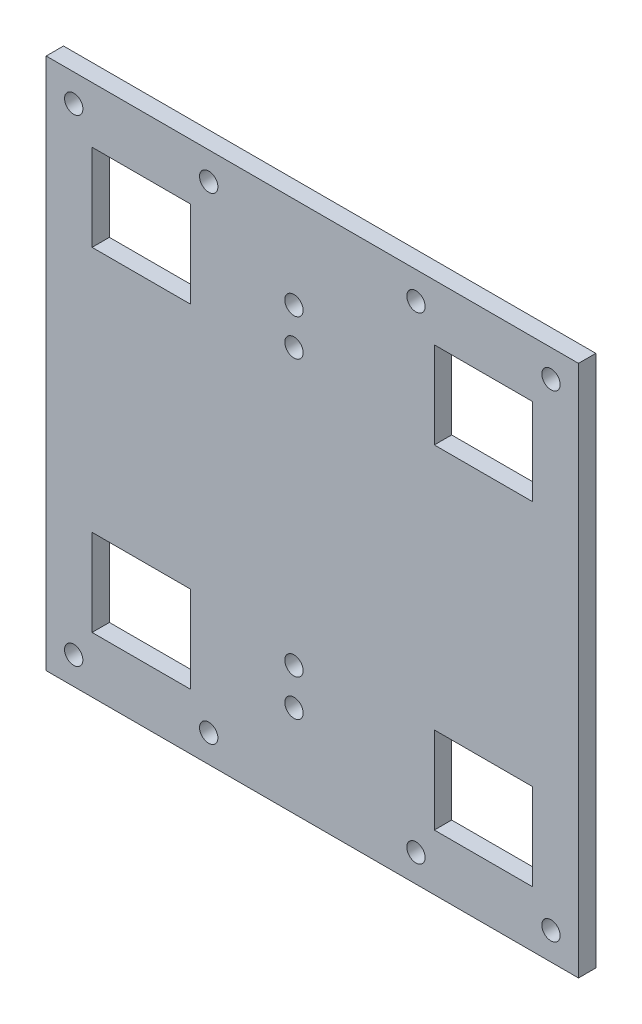
ISO-10303-21;
HEADER;
FILE_DESCRIPTION(('STEP AP214'),'2;1');
FILE_NAME('part.step','',(''),(''),'','','');
FILE_SCHEMA(('AUTOMOTIVE_DESIGN { 1 0 10303 214 1 1 1 1 }'));
ENDSEC;
DATA;
#1=APPLICATION_CONTEXT('core data for automotive mechanical design processes');
#2=APPLICATION_PROTOCOL_DEFINITION('international standard','automotive_design',2000,#1);
#3=PRODUCT_CONTEXT('',#1,'mechanical');
#4=PRODUCT('Part','Part','',(#3));
#5=PRODUCT_RELATED_PRODUCT_CATEGORY('part','',(#4));
#6=PRODUCT_DEFINITION_FORMATION('','',#4);
#7=PRODUCT_DEFINITION_CONTEXT('part definition',#1,'design');
#8=PRODUCT_DEFINITION('design','',#6,#7);
#9=PRODUCT_DEFINITION_SHAPE('','',#8);
#10=(LENGTH_UNIT() NAMED_UNIT(*) SI_UNIT(.MILLI.,.METRE.));
#11=(NAMED_UNIT(*) PLANE_ANGLE_UNIT() SI_UNIT($,.RADIAN.));
#12=(NAMED_UNIT(*) SI_UNIT($,.STERADIAN.) SOLID_ANGLE_UNIT());
#13=UNCERTAINTY_MEASURE_WITH_UNIT(LENGTH_MEASURE(1.E-05),#10,'distance_accuracy_value','');
#14=(GEOMETRIC_REPRESENTATION_CONTEXT(3) GLOBAL_UNCERTAINTY_ASSIGNED_CONTEXT((#13)) GLOBAL_UNIT_ASSIGNED_CONTEXT((#10,
#11,#12)) REPRESENTATION_CONTEXT('',''));
#15=CARTESIAN_POINT('',(0.,0.,0.));
#16=DIRECTION('',(0.,0.,1.));
#17=DIRECTION('',(1.,0.,0.));
#18=AXIS2_PLACEMENT_3D('',#15,#16,#17);
#19=CARTESIAN_POINT('',(0.,0.,5.9944));
#20=DIRECTION('',(0.,0.,-1.));
#21=DIRECTION('',(-1.,0.,0.));
#22=AXIS2_PLACEMENT_3D('',#19,#20,#21);
#23=PLANE('',#22);
#24=CARTESIAN_POINT('',(85.725,44.45,5.9944));
#25=DIRECTION('',(0.,0.,1.));
#26=DIRECTION('',(1.,0.,0.));
#27=AXIS2_PLACEMENT_3D('',#24,#25,#26);
#28=CIRCLE('',#27,3.175);
#29=CARTESIAN_POINT('',(88.9,44.45,5.9944));
#30=VERTEX_POINT('',#29);
#31=EDGE_CURVE('E533',#30,#30,#28,.T.);
#32=ORIENTED_EDGE('',*,*,#31,.F.);
#33=EDGE_LOOP('',(#32));
#34=FACE_BOUND('',#33,.T.);
#35=CARTESIAN_POINT('',(85.725,152.4,5.9944));
#36=DIRECTION('',(0.,0.,1.));
#37=DIRECTION('',(1.,0.,0.));
#38=AXIS2_PLACEMENT_3D('',#35,#36,#37);
#39=CIRCLE('',#38,3.175);
#40=CARTESIAN_POINT('',(88.9,152.4,5.9944));
#41=VERTEX_POINT('',#40);
#42=EDGE_CURVE('E545',#41,#41,#39,.T.);
#43=ORIENTED_EDGE('',*,*,#42,.F.);
#44=EDGE_LOOP('',(#43));
#45=FACE_BOUND('',#44,.T.);
#46=CARTESIAN_POINT('',(127.92456,9.525,5.9944));
#47=DIRECTION('',(0.,0.,1.));
#48=DIRECTION('',(1.,0.,0.));
#49=AXIS2_PLACEMENT_3D('',#46,#47,#48);
#50=CIRCLE('',#49,3.175);
#51=CARTESIAN_POINT('',(131.09956,9.525,5.9944));
#52=VERTEX_POINT('',#51);
#53=EDGE_CURVE('E198',#52,#52,#50,.T.);
#54=ORIENTED_EDGE('',*,*,#53,.F.);
#55=EDGE_LOOP('',(#54));
#56=FACE_BOUND('',#55,.T.);
#57=CARTESIAN_POINT('',(56.22544,9.525,5.9944));
#58=DIRECTION('',(0.,0.,1.));
#59=DIRECTION('',(1.,0.,0.));
#60=AXIS2_PLACEMENT_3D('',#57,#58,#59);
#61=CIRCLE('',#60,3.175);
#62=CARTESIAN_POINT('',(59.40044,9.525,5.9944));
#63=VERTEX_POINT('',#62);
#64=EDGE_CURVE('E208',#63,#63,#61,.T.);
#65=ORIENTED_EDGE('',*,*,#64,.F.);
#66=EDGE_LOOP('',(#65));
#67=FACE_BOUND('',#66,.T.);
#68=DIRECTION('',(0.,-1.,0.));
#69=VECTOR('',#68,1.);
#70=CARTESIAN_POINT('',(134.27478,164.76218,5.9944));
#71=LINE('',#70,#69);
#72=CARTESIAN_POINT('',(134.27478,164.76218,5.9944));
#73=VERTEX_POINT('',#72);
#74=CARTESIAN_POINT('',(134.27478,134.76218,5.9944));
#75=VERTEX_POINT('',#74);
#76=EDGE_CURVE('E220',#73,#75,#71,.T.);
#77=ORIENTED_EDGE('',*,*,#76,.F.);
#78=DIRECTION('',(-1.,0.,0.));
#79=VECTOR('',#78,1.);
#80=CARTESIAN_POINT('',(134.27478,164.76218,5.9944));
#81=LINE('',#80,#79);
#82=CARTESIAN_POINT('',(168.27478,164.76218,5.9944));
#83=VERTEX_POINT('',#82);
#84=EDGE_CURVE('E228',#83,#73,#81,.T.);
#85=ORIENTED_EDGE('',*,*,#84,.F.);
#86=DIRECTION('',(0.,1.,0.));
#87=VECTOR('',#86,1.);
#88=CARTESIAN_POINT('',(168.27478,164.76218,5.9944));
#89=LINE('',#88,#87);
#90=CARTESIAN_POINT('',(168.27478,134.76218,5.9944));
#91=VERTEX_POINT('',#90);
#92=EDGE_CURVE('E225',#91,#83,#89,.T.);
#93=ORIENTED_EDGE('',*,*,#92,.F.);
#94=DIRECTION('',(1.,0.,0.));
#95=VECTOR('',#94,1.);
#96=CARTESIAN_POINT('',(134.27478,134.76218,5.9944));
#97=LINE('',#96,#95);
#98=EDGE_CURVE('E222',#75,#91,#97,.T.);
#99=ORIENTED_EDGE('',*,*,#98,.F.);
#100=EDGE_LOOP('',(#77,#85,#93,#99));
#101=FACE_BOUND('',#100,.T.);
#102=DIRECTION('',(0.,-1.,0.));
#103=VECTOR('',#102,1.);
#104=CARTESIAN_POINT('',(15.87522,164.76218,5.9944));
#105=LINE('',#104,#103);
#106=CARTESIAN_POINT('',(15.87522,164.76218,5.9944));
#107=VERTEX_POINT('',#106);
#108=CARTESIAN_POINT('',(15.87522,134.76218,5.9944));
#109=VERTEX_POINT('',#108);
#110=EDGE_CURVE('E282',#107,#109,#105,.T.);
#111=ORIENTED_EDGE('',*,*,#110,.F.);
#112=DIRECTION('',(-1.,0.,0.));
#113=VECTOR('',#112,1.);
#114=CARTESIAN_POINT('',(15.87522,164.76218,5.9944));
#115=LINE('',#114,#113);
#116=CARTESIAN_POINT('',(49.87522,164.76218,5.9944));
#117=VERTEX_POINT('',#116);
#118=EDGE_CURVE('E290',#117,#107,#115,.T.);
#119=ORIENTED_EDGE('',*,*,#118,.F.);
#120=DIRECTION('',(0.,1.,0.));
#121=VECTOR('',#120,1.);
#122=CARTESIAN_POINT('',(49.87522,164.76218,5.9944));
#123=LINE('',#122,#121);
#124=CARTESIAN_POINT('',(49.87522,134.76218,5.9944));
#125=VERTEX_POINT('',#124);
#126=EDGE_CURVE('E287',#125,#117,#123,.T.);
#127=ORIENTED_EDGE('',*,*,#126,.F.);
#128=DIRECTION('',(1.,0.,0.));
#129=VECTOR('',#128,1.);
#130=CARTESIAN_POINT('',(15.87522,134.76218,5.9944));
#131=LINE('',#130,#129);
#132=EDGE_CURVE('E284',#109,#125,#131,.T.);
#133=ORIENTED_EDGE('',*,*,#132,.F.);
#134=EDGE_LOOP('',(#111,#119,#127,#133));
#135=FACE_BOUND('',#134,.T.);
#136=CARTESIAN_POINT('',(127.92456,174.625,5.9944));
#137=DIRECTION('',(0.,0.,1.));
#138=DIRECTION('',(1.,0.,0.));
#139=AXIS2_PLACEMENT_3D('',#136,#137,#138);
#140=CIRCLE('',#139,3.17499999999997);
#141=CARTESIAN_POINT('',(131.09956,174.625,5.9944));
#142=VERTEX_POINT('',#141);
#143=EDGE_CURVE('E319',#142,#142,#140,.T.);
#144=ORIENTED_EDGE('',*,*,#143,.F.);
#145=EDGE_LOOP('',(#144));
#146=FACE_BOUND('',#145,.T.);
#147=CARTESIAN_POINT('',(9.525,174.625,5.9944));
#148=DIRECTION('',(0.,0.,1.));
#149=DIRECTION('',(1.,0.,0.));
#150=AXIS2_PLACEMENT_3D('',#147,#148,#149);
#151=CIRCLE('',#150,3.175);
#152=CARTESIAN_POINT('',(12.7,174.625,5.9944));
#153=VERTEX_POINT('',#152);
#154=EDGE_CURVE('E331',#153,#153,#151,.T.);
#155=ORIENTED_EDGE('',*,*,#154,.F.);
#156=EDGE_LOOP('',(#155));
#157=FACE_BOUND('',#156,.T.);
#158=DIRECTION('',(0.,-1.,0.));
#159=VECTOR('',#158,1.);
#160=CARTESIAN_POINT('',(0.,0.,5.9944));
#161=LINE('',#160,#159);
#162=CARTESIAN_POINT('',(0.,184.15,5.9944));
#163=VERTEX_POINT('',#162);
#164=CARTESIAN_POINT('',(0.,0.,5.9944));
#165=VERTEX_POINT('',#164);
#166=EDGE_CURVE('E337',#163,#165,#161,.T.);
#167=ORIENTED_EDGE('',*,*,#166,.T.);
#168=DIRECTION('',(1.,0.,0.));
#169=VECTOR('',#168,1.);
#170=CARTESIAN_POINT('',(0.,0.,5.9944));
#171=LINE('',#170,#169);
#172=CARTESIAN_POINT('',(184.15,0.,5.9944));
#173=VERTEX_POINT('',#172);
#174=EDGE_CURVE('E340',#165,#173,#171,.T.);
#175=ORIENTED_EDGE('',*,*,#174,.T.);
#176=DIRECTION('',(0.,1.,0.));
#177=VECTOR('',#176,1.);
#178=CARTESIAN_POINT('',(184.15,0.,5.9944));
#179=LINE('',#178,#177);
#180=CARTESIAN_POINT('',(184.15,184.15,5.9944));
#181=VERTEX_POINT('',#180);
#182=EDGE_CURVE('E343',#173,#181,#179,.T.);
#183=ORIENTED_EDGE('',*,*,#182,.T.);
#184=DIRECTION('',(-1.,0.,0.));
#185=VECTOR('',#184,1.);
#186=CARTESIAN_POINT('',(0.,184.15,5.9944));
#187=LINE('',#186,#185);
#188=EDGE_CURVE('E345',#181,#163,#187,.T.);
#189=ORIENTED_EDGE('',*,*,#188,.T.);
#190=EDGE_LOOP('',(#167,#175,#183,#189));
#191=FACE_BOUND('',#190,.T.);
#192=CARTESIAN_POINT('',(56.22544,174.625,5.9944));
#193=DIRECTION('',(0.,0.,1.));
#194=DIRECTION('',(1.,0.,0.));
#195=AXIS2_PLACEMENT_3D('',#192,#193,#194);
#196=CIRCLE('',#195,3.175);
#197=CARTESIAN_POINT('',(59.40044,174.625,5.9944));
#198=VERTEX_POINT('',#197);
#199=EDGE_CURVE('E325',#198,#198,#196,.T.);
#200=ORIENTED_EDGE('',*,*,#199,.F.);
#201=EDGE_LOOP('',(#200));
#202=FACE_BOUND('',#201,.T.);
#203=CARTESIAN_POINT('',(174.625,174.625,5.9944));
#204=DIRECTION('',(0.,0.,1.));
#205=DIRECTION('',(1.,0.,0.));
#206=AXIS2_PLACEMENT_3D('',#203,#204,#205);
#207=CIRCLE('',#206,3.175);
#208=CARTESIAN_POINT('',(177.8,174.625,5.9944));
#209=VERTEX_POINT('',#208);
#210=EDGE_CURVE('E313',#209,#209,#207,.T.);
#211=ORIENTED_EDGE('',*,*,#210,.F.);
#212=EDGE_LOOP('',(#211));
#213=FACE_BOUND('',#212,.T.);
#214=DIRECTION('',(0.,-1.,0.));
#215=VECTOR('',#214,1.);
#216=CARTESIAN_POINT('',(15.87522,49.38782,5.9944));
#217=LINE('',#216,#215);
#218=CARTESIAN_POINT('',(15.87522,49.38782,5.9944));
#219=VERTEX_POINT('',#218);
#220=CARTESIAN_POINT('',(15.87522,19.38782,5.9944));
#221=VERTEX_POINT('',#220);
#222=EDGE_CURVE('E251',#219,#221,#217,.T.);
#223=ORIENTED_EDGE('',*,*,#222,.F.);
#224=DIRECTION('',(-1.,0.,0.));
#225=VECTOR('',#224,1.);
#226=CARTESIAN_POINT('',(15.87522,49.38782,5.9944));
#227=LINE('',#226,#225);
#228=CARTESIAN_POINT('',(49.87522,49.38782,5.9944));
#229=VERTEX_POINT('',#228);
#230=EDGE_CURVE('E259',#229,#219,#227,.T.);
#231=ORIENTED_EDGE('',*,*,#230,.F.);
#232=DIRECTION('',(0.,1.,0.));
#233=VECTOR('',#232,1.);
#234=CARTESIAN_POINT('',(49.87522,49.38782,5.9944));
#235=LINE('',#234,#233);
#236=CARTESIAN_POINT('',(49.87522,19.38782,5.9944));
#237=VERTEX_POINT('',#236);
#238=EDGE_CURVE('E256',#237,#229,#235,.T.);
#239=ORIENTED_EDGE('',*,*,#238,.F.);
#240=DIRECTION('',(1.,0.,0.));
#241=VECTOR('',#240,1.);
#242=CARTESIAN_POINT('',(15.87522,19.38782,5.9944));
#243=LINE('',#242,#241);
#244=EDGE_CURVE('E253',#221,#237,#243,.T.);
#245=ORIENTED_EDGE('',*,*,#244,.F.);
#246=EDGE_LOOP('',(#223,#231,#239,#245));
#247=FACE_BOUND('',#246,.T.);
#248=CARTESIAN_POINT('',(9.525,9.525,5.9944));
#249=DIRECTION('',(0.,0.,1.));
#250=DIRECTION('',(1.,0.,0.));
#251=AXIS2_PLACEMENT_3D('',#248,#249,#250);
#252=CIRCLE('',#251,3.175);
#253=CARTESIAN_POINT('',(12.7,9.525,5.9944));
#254=VERTEX_POINT('',#253);
#255=EDGE_CURVE('E214',#254,#254,#252,.T.);
#256=ORIENTED_EDGE('',*,*,#255,.F.);
#257=EDGE_LOOP('',(#256));
#258=FACE_BOUND('',#257,.T.);
#259=DIRECTION('',(0.,-1.,0.));
#260=VECTOR('',#259,1.);
#261=CARTESIAN_POINT('',(134.27478,49.38782,5.9944));
#262=LINE('',#261,#260);
#263=CARTESIAN_POINT('',(134.27478,49.38782,5.9944));
#264=VERTEX_POINT('',#263);
#265=CARTESIAN_POINT('',(134.27478,19.38782,5.9944));
#266=VERTEX_POINT('',#265);
#267=EDGE_CURVE('E169',#264,#266,#262,.T.);
#268=ORIENTED_EDGE('',*,*,#267,.F.);
#269=DIRECTION('',(-1.,0.,0.));
#270=VECTOR('',#269,1.);
#271=CARTESIAN_POINT('',(134.27478,49.38782,5.9944));
#272=LINE('',#271,#270);
#273=CARTESIAN_POINT('',(168.27478,49.38782,5.9944));
#274=VERTEX_POINT('',#273);
#275=EDGE_CURVE('E192',#274,#264,#272,.T.);
#276=ORIENTED_EDGE('',*,*,#275,.F.);
#277=DIRECTION('',(0.,1.,0.));
#278=VECTOR('',#277,1.);
#279=CARTESIAN_POINT('',(168.27478,49.38782,5.9944));
#280=LINE('',#279,#278);
#281=CARTESIAN_POINT('',(168.27478,19.38782,5.9944));
#282=VERTEX_POINT('',#281);
#283=EDGE_CURVE('E190',#282,#274,#280,.T.);
#284=ORIENTED_EDGE('',*,*,#283,.F.);
#285=DIRECTION('',(1.,0.,0.));
#286=VECTOR('',#285,1.);
#287=CARTESIAN_POINT('',(134.27478,19.38782,5.9944));
#288=LINE('',#287,#286);
#289=EDGE_CURVE('E177',#266,#282,#288,.T.);
#290=ORIENTED_EDGE('',*,*,#289,.F.);
#291=EDGE_LOOP('',(#268,#276,#284,#290));
#292=FACE_BOUND('',#291,.T.);
#293=CARTESIAN_POINT('',(174.61738,9.525,5.9944));
#294=DIRECTION('',(0.,0.,1.));
#295=DIRECTION('',(1.,0.,0.));
#296=AXIS2_PLACEMENT_3D('',#293,#294,#295);
#297=CIRCLE('',#296,3.175);
#298=CARTESIAN_POINT('',(177.79238,9.525,5.9944));
#299=VERTEX_POINT('',#298);
#300=EDGE_CURVE('E551',#299,#299,#297,.T.);
#301=ORIENTED_EDGE('',*,*,#300,.F.);
#302=EDGE_LOOP('',(#301));
#303=FACE_BOUND('',#302,.T.);
#304=CARTESIAN_POINT('',(85.725,139.7,5.9944));
#305=DIRECTION('',(0.,0.,1.));
#306=DIRECTION('',(1.,0.,0.));
#307=AXIS2_PLACEMENT_3D('',#304,#305,#306);
#308=CIRCLE('',#307,3.175);
#309=CARTESIAN_POINT('',(88.9,139.7,5.9944));
#310=VERTEX_POINT('',#309);
#311=EDGE_CURVE('E539',#310,#310,#308,.T.);
#312=ORIENTED_EDGE('',*,*,#311,.F.);
#313=EDGE_LOOP('',(#312));
#314=FACE_BOUND('',#313,.T.);
#315=CARTESIAN_POINT('',(85.725,31.75,5.9944));
#316=DIRECTION('',(0.,0.,1.));
#317=DIRECTION('',(1.,0.,0.));
#318=AXIS2_PLACEMENT_3D('',#315,#316,#317);
#319=CIRCLE('',#318,3.175);
#320=CARTESIAN_POINT('',(88.9,31.75,5.9944));
#321=VERTEX_POINT('',#320);
#322=EDGE_CURVE('E524',#321,#321,#319,.T.);
#323=ORIENTED_EDGE('',*,*,#322,.F.);
#324=EDGE_LOOP('',(#323));
#325=FACE_BOUND('',#324,.T.);
#326=ADVANCED_FACE('F32',(#34,#45,#56,#67,#101,#135,#146,#157,#191,#202,#213,#247,#258,#292,
#303,#314,#325),#23,.F.);
#327=CARTESIAN_POINT('',(0.,0.,0.));
#328=DIRECTION('',(0.,0.,-1.));
#329=DIRECTION('',(-1.,0.,0.));
#330=AXIS2_PLACEMENT_3D('',#327,#328,#329);
#331=PLANE('',#330);
#332=CARTESIAN_POINT('',(85.725,44.45,0.));
#333=DIRECTION('',(0.,0.,1.));
#334=DIRECTION('',(1.,0.,0.));
#335=AXIS2_PLACEMENT_3D('',#332,#333,#334);
#336=CIRCLE('',#335,3.175);
#337=CARTESIAN_POINT('',(88.9,44.45,0.));
#338=VERTEX_POINT('',#337);
#339=EDGE_CURVE('E530',#338,#338,#336,.T.);
#340=ORIENTED_EDGE('',*,*,#339,.T.);
#341=EDGE_LOOP('',(#340));
#342=FACE_BOUND('',#341,.T.);
#343=CARTESIAN_POINT('',(85.725,152.4,0.));
#344=DIRECTION('',(0.,0.,1.));
#345=DIRECTION('',(1.,0.,0.));
#346=AXIS2_PLACEMENT_3D('',#343,#344,#345);
#347=CIRCLE('',#346,3.175);
#348=CARTESIAN_POINT('',(88.9,152.4,0.));
#349=VERTEX_POINT('',#348);
#350=EDGE_CURVE('E542',#349,#349,#347,.T.);
#351=ORIENTED_EDGE('',*,*,#350,.T.);
#352=EDGE_LOOP('',(#351));
#353=FACE_BOUND('',#352,.T.);
#354=CARTESIAN_POINT('',(127.92456,9.525,0.));
#355=DIRECTION('',(0.,0.,1.));
#356=DIRECTION('',(1.,0.,0.));
#357=AXIS2_PLACEMENT_3D('',#354,#355,#356);
#358=CIRCLE('',#357,3.175);
#359=CARTESIAN_POINT('',(131.09956,9.525,0.));
#360=VERTEX_POINT('',#359);
#361=EDGE_CURVE('E554',#360,#360,#358,.T.);
#362=ORIENTED_EDGE('',*,*,#361,.T.);
#363=EDGE_LOOP('',(#362));
#364=FACE_BOUND('',#363,.T.);
#365=CARTESIAN_POINT('',(56.22544,9.525,0.));
#366=DIRECTION('',(0.,0.,1.));
#367=DIRECTION('',(1.,0.,0.));
#368=AXIS2_PLACEMENT_3D('',#365,#366,#367);
#369=CIRCLE('',#368,3.175);
#370=CARTESIAN_POINT('',(59.40044,9.525,0.));
#371=VERTEX_POINT('',#370);
#372=EDGE_CURVE('E185',#371,#371,#369,.T.);
#373=ORIENTED_EDGE('',*,*,#372,.T.);
#374=EDGE_LOOP('',(#373));
#375=FACE_BOUND('',#374,.T.);
#376=DIRECTION('',(-1.,0.,0.));
#377=VECTOR('',#376,1.);
#378=CARTESIAN_POINT('',(134.27478,164.76218,0.));
#379=LINE('',#378,#377);
#380=CARTESIAN_POINT('',(168.27478,164.76218,0.));
#381=VERTEX_POINT('',#380);
#382=CARTESIAN_POINT('',(134.27478,164.76218,0.));
#383=VERTEX_POINT('',#382);
#384=EDGE_CURVE('E223',#381,#383,#379,.T.);
#385=ORIENTED_EDGE('',*,*,#384,.T.);
#386=DIRECTION('',(0.,-1.,0.));
#387=VECTOR('',#386,1.);
#388=CARTESIAN_POINT('',(134.27478,164.76218,0.));
#389=LINE('',#388,#387);
#390=CARTESIAN_POINT('',(134.27478,134.76218,0.));
#391=VERTEX_POINT('',#390);
#392=EDGE_CURVE('E217',#383,#391,#389,.T.);
#393=ORIENTED_EDGE('',*,*,#392,.T.);
#394=DIRECTION('',(1.,0.,0.));
#395=VECTOR('',#394,1.);
#396=CARTESIAN_POINT('',(134.27478,134.76218,0.));
#397=LINE('',#396,#395);
#398=CARTESIAN_POINT('',(168.27478,134.76218,0.));
#399=VERTEX_POINT('',#398);
#400=EDGE_CURVE('E233',#391,#399,#397,.T.);
#401=ORIENTED_EDGE('',*,*,#400,.T.);
#402=DIRECTION('',(0.,1.,0.));
#403=VECTOR('',#402,1.);
#404=CARTESIAN_POINT('',(168.27478,164.76218,0.));
#405=LINE('',#404,#403);
#406=EDGE_CURVE('E236',#399,#381,#405,.T.);
#407=ORIENTED_EDGE('',*,*,#406,.T.);
#408=EDGE_LOOP('',(#385,#393,#401,#407));
#409=FACE_BOUND('',#408,.T.);
#410=DIRECTION('',(-1.,0.,0.));
#411=VECTOR('',#410,1.);
#412=CARTESIAN_POINT('',(15.87522,164.76218,0.));
#413=LINE('',#412,#411);
#414=CARTESIAN_POINT('',(49.87522,164.76218,0.));
#415=VERTEX_POINT('',#414);
#416=CARTESIAN_POINT('',(15.87522,164.76218,0.));
#417=VERTEX_POINT('',#416);
#418=EDGE_CURVE('E285',#415,#417,#413,.T.);
#419=ORIENTED_EDGE('',*,*,#418,.T.);
#420=DIRECTION('',(0.,-1.,0.));
#421=VECTOR('',#420,1.);
#422=CARTESIAN_POINT('',(15.87522,164.76218,0.));
#423=LINE('',#422,#421);
#424=CARTESIAN_POINT('',(15.87522,134.76218,0.));
#425=VERTEX_POINT('',#424);
#426=EDGE_CURVE('E281',#417,#425,#423,.T.);
#427=ORIENTED_EDGE('',*,*,#426,.T.);
#428=DIRECTION('',(1.,0.,0.));
#429=VECTOR('',#428,1.);
#430=CARTESIAN_POINT('',(15.87522,134.76218,0.));
#431=LINE('',#430,#429);
#432=CARTESIAN_POINT('',(49.87522,134.76218,0.));
#433=VERTEX_POINT('',#432);
#434=EDGE_CURVE('E295',#425,#433,#431,.T.);
#435=ORIENTED_EDGE('',*,*,#434,.T.);
#436=DIRECTION('',(0.,1.,0.));
#437=VECTOR('',#436,1.);
#438=CARTESIAN_POINT('',(49.87522,164.76218,0.));
#439=LINE('',#438,#437);
#440=EDGE_CURVE('E298',#433,#415,#439,.T.);
#441=ORIENTED_EDGE('',*,*,#440,.T.);
#442=EDGE_LOOP('',(#419,#427,#435,#441));
#443=FACE_BOUND('',#442,.T.);
#444=CARTESIAN_POINT('',(127.92456,174.625,0.));
#445=DIRECTION('',(0.,0.,1.));
#446=DIRECTION('',(1.,0.,0.));
#447=AXIS2_PLACEMENT_3D('',#444,#445,#446);
#448=CIRCLE('',#447,3.17499999999997);
#449=CARTESIAN_POINT('',(131.09956,174.625,0.));
#450=VERTEX_POINT('',#449);
#451=EDGE_CURVE('E316',#450,#450,#448,.T.);
#452=ORIENTED_EDGE('',*,*,#451,.T.);
#453=EDGE_LOOP('',(#452));
#454=FACE_BOUND('',#453,.T.);
#455=CARTESIAN_POINT('',(9.525,174.625,0.));
#456=DIRECTION('',(0.,0.,1.));
#457=DIRECTION('',(1.,0.,0.));
#458=AXIS2_PLACEMENT_3D('',#455,#456,#457);
#459=CIRCLE('',#458,3.175);
#460=CARTESIAN_POINT('',(12.7,174.625,0.));
#461=VERTEX_POINT('',#460);
#462=EDGE_CURVE('E328',#461,#461,#459,.T.);
#463=ORIENTED_EDGE('',*,*,#462,.T.);
#464=EDGE_LOOP('',(#463));
#465=FACE_BOUND('',#464,.T.);
#466=DIRECTION('',(0.,-1.,0.));
#467=VECTOR('',#466,1.);
#468=CARTESIAN_POINT('',(0.,0.,0.));
#469=LINE('',#468,#467);
#470=CARTESIAN_POINT('',(0.,184.15,0.));
#471=VERTEX_POINT('',#470);
#472=CARTESIAN_POINT('',(0.,0.,0.));
#473=VERTEX_POINT('',#472);
#474=EDGE_CURVE('E334',#471,#473,#469,.T.);
#475=ORIENTED_EDGE('',*,*,#474,.F.);
#476=DIRECTION('',(-1.,0.,0.));
#477=VECTOR('',#476,1.);
#478=CARTESIAN_POINT('',(0.,184.15,0.));
#479=LINE('',#478,#477);
#480=CARTESIAN_POINT('',(184.15,184.15,0.));
#481=VERTEX_POINT('',#480);
#482=EDGE_CURVE('E341',#481,#471,#479,.T.);
#483=ORIENTED_EDGE('',*,*,#482,.F.);
#484=DIRECTION('',(0.,1.,0.));
#485=VECTOR('',#484,1.);
#486=CARTESIAN_POINT('',(184.15,0.,0.));
#487=LINE('',#486,#485);
#488=CARTESIAN_POINT('',(184.15,0.,0.));
#489=VERTEX_POINT('',#488);
#490=EDGE_CURVE('E352',#489,#481,#487,.T.);
#491=ORIENTED_EDGE('',*,*,#490,.F.);
#492=DIRECTION('',(1.,0.,0.));
#493=VECTOR('',#492,1.);
#494=CARTESIAN_POINT('',(0.,0.,0.));
#495=LINE('',#494,#493);
#496=EDGE_CURVE('E350',#473,#489,#495,.T.);
#497=ORIENTED_EDGE('',*,*,#496,.F.);
#498=EDGE_LOOP('',(#475,#483,#491,#497));
#499=FACE_BOUND('',#498,.T.);
#500=CARTESIAN_POINT('',(56.22544,174.625,0.));
#501=DIRECTION('',(0.,0.,1.));
#502=DIRECTION('',(1.,0.,0.));
#503=AXIS2_PLACEMENT_3D('',#500,#501,#502);
#504=CIRCLE('',#503,3.175);
#505=CARTESIAN_POINT('',(59.40044,174.625,0.));
#506=VERTEX_POINT('',#505);
#507=EDGE_CURVE('E322',#506,#506,#504,.T.);
#508=ORIENTED_EDGE('',*,*,#507,.T.);
#509=EDGE_LOOP('',(#508));
#510=FACE_BOUND('',#509,.T.);
#511=CARTESIAN_POINT('',(174.625,174.625,0.));
#512=DIRECTION('',(0.,0.,1.));
#513=DIRECTION('',(1.,0.,0.));
#514=AXIS2_PLACEMENT_3D('',#511,#512,#513);
#515=CIRCLE('',#514,3.175);
#516=CARTESIAN_POINT('',(177.8,174.625,0.));
#517=VERTEX_POINT('',#516);
#518=EDGE_CURVE('E312',#517,#517,#515,.T.);
#519=ORIENTED_EDGE('',*,*,#518,.T.);
#520=EDGE_LOOP('',(#519));
#521=FACE_BOUND('',#520,.T.);
#522=DIRECTION('',(-1.,0.,0.));
#523=VECTOR('',#522,1.);
#524=CARTESIAN_POINT('',(15.87522,49.38782,0.));
#525=LINE('',#524,#523);
#526=CARTESIAN_POINT('',(49.87522,49.38782,0.));
#527=VERTEX_POINT('',#526);
#528=CARTESIAN_POINT('',(15.87522,49.38782,0.));
#529=VERTEX_POINT('',#528);
#530=EDGE_CURVE('E254',#527,#529,#525,.T.);
#531=ORIENTED_EDGE('',*,*,#530,.T.);
#532=DIRECTION('',(0.,-1.,0.));
#533=VECTOR('',#532,1.);
#534=CARTESIAN_POINT('',(15.87522,49.38782,0.));
#535=LINE('',#534,#533);
#536=CARTESIAN_POINT('',(15.87522,19.38782,0.));
#537=VERTEX_POINT('',#536);
#538=EDGE_CURVE('E250',#529,#537,#535,.T.);
#539=ORIENTED_EDGE('',*,*,#538,.T.);
#540=DIRECTION('',(1.,0.,0.));
#541=VECTOR('',#540,1.);
#542=CARTESIAN_POINT('',(15.87522,19.38782,0.));
#543=LINE('',#542,#541);
#544=CARTESIAN_POINT('',(49.87522,19.38782,0.));
#545=VERTEX_POINT('',#544);
#546=EDGE_CURVE('E264',#537,#545,#543,.T.);
#547=ORIENTED_EDGE('',*,*,#546,.T.);
#548=DIRECTION('',(0.,1.,0.));
#549=VECTOR('',#548,1.);
#550=CARTESIAN_POINT('',(49.87522,49.38782,0.));
#551=LINE('',#550,#549);
#552=EDGE_CURVE('E267',#545,#527,#551,.T.);
#553=ORIENTED_EDGE('',*,*,#552,.T.);
#554=EDGE_LOOP('',(#531,#539,#547,#553));
#555=FACE_BOUND('',#554,.T.);
#556=CARTESIAN_POINT('',(9.525,9.525,0.));
#557=DIRECTION('',(0.,0.,1.));
#558=DIRECTION('',(1.,0.,0.));
#559=AXIS2_PLACEMENT_3D('',#556,#557,#558);
#560=CIRCLE('',#559,3.175);
#561=CARTESIAN_POINT('',(12.7,9.525,0.));
#562=VERTEX_POINT('',#561);
#563=EDGE_CURVE('E211',#562,#562,#560,.T.);
#564=ORIENTED_EDGE('',*,*,#563,.T.);
#565=EDGE_LOOP('',(#564));
#566=FACE_BOUND('',#565,.T.);
#567=DIRECTION('',(-1.,0.,0.));
#568=VECTOR('',#567,1.);
#569=CARTESIAN_POINT('',(134.27478,49.38782,0.));
#570=LINE('',#569,#568);
#571=CARTESIAN_POINT('',(168.27478,49.38782,0.));
#572=VERTEX_POINT('',#571);
#573=CARTESIAN_POINT('',(134.27478,49.38782,0.));
#574=VERTEX_POINT('',#573);
#575=EDGE_CURVE('E178',#572,#574,#570,.T.);
#576=ORIENTED_EDGE('',*,*,#575,.T.);
#577=DIRECTION('',(0.,-1.,0.));
#578=VECTOR('',#577,1.);
#579=CARTESIAN_POINT('',(134.27478,49.38782,0.));
#580=LINE('',#579,#578);
#581=CARTESIAN_POINT('',(134.27478,19.38782,0.));
#582=VERTEX_POINT('',#581);
#583=EDGE_CURVE('E55',#574,#582,#580,.T.);
#584=ORIENTED_EDGE('',*,*,#583,.T.);
#585=DIRECTION('',(1.,0.,0.));
#586=VECTOR('',#585,1.);
#587=CARTESIAN_POINT('',(134.27478,19.38782,0.));
#588=LINE('',#587,#586);
#589=CARTESIAN_POINT('',(168.27478,19.38782,0.));
#590=VERTEX_POINT('',#589);
#591=EDGE_CURVE('E184',#582,#590,#588,.T.);
#592=ORIENTED_EDGE('',*,*,#591,.T.);
#593=DIRECTION('',(0.,1.,0.));
#594=VECTOR('',#593,1.);
#595=CARTESIAN_POINT('',(168.27478,49.38782,0.));
#596=LINE('',#595,#594);
#597=EDGE_CURVE('E200',#590,#572,#596,.T.);
#598=ORIENTED_EDGE('',*,*,#597,.T.);
#599=EDGE_LOOP('',(#576,#584,#592,#598));
#600=FACE_BOUND('',#599,.T.);
#601=CARTESIAN_POINT('',(174.61738,9.525,0.));
#602=DIRECTION('',(0.,0.,1.));
#603=DIRECTION('',(1.,0.,0.));
#604=AXIS2_PLACEMENT_3D('',#601,#602,#603);
#605=CIRCLE('',#604,3.175);
#606=CARTESIAN_POINT('',(177.79238,9.525,0.));
#607=VERTEX_POINT('',#606);
#608=EDGE_CURVE('E548',#607,#607,#605,.T.);
#609=ORIENTED_EDGE('',*,*,#608,.T.);
#610=EDGE_LOOP('',(#609));
#611=FACE_BOUND('',#610,.T.);
#612=CARTESIAN_POINT('',(85.725,139.7,0.));
#613=DIRECTION('',(0.,0.,1.));
#614=DIRECTION('',(1.,0.,0.));
#615=AXIS2_PLACEMENT_3D('',#612,#613,#614);
#616=CIRCLE('',#615,3.175);
#617=CARTESIAN_POINT('',(88.9,139.7,0.));
#618=VERTEX_POINT('',#617);
#619=EDGE_CURVE('E536',#618,#618,#616,.T.);
#620=ORIENTED_EDGE('',*,*,#619,.T.);
#621=EDGE_LOOP('',(#620));
#622=FACE_BOUND('',#621,.T.);
#623=CARTESIAN_POINT('',(85.725,31.75,0.));
#624=DIRECTION('',(0.,0.,1.));
#625=DIRECTION('',(1.,0.,0.));
#626=AXIS2_PLACEMENT_3D('',#623,#624,#625);
#627=CIRCLE('',#626,3.175);
#628=CARTESIAN_POINT('',(88.9,31.75,0.));
#629=VERTEX_POINT('',#628);
#630=EDGE_CURVE('E527',#629,#629,#627,.T.);
#631=ORIENTED_EDGE('',*,*,#630,.T.);
#632=EDGE_LOOP('',(#631));
#633=FACE_BOUND('',#632,.T.);
#634=ADVANCED_FACE('F370',(#342,#353,#364,#375,#409,#443,#454,#465,#499,#510,#521,#555,#566,
#600,#611,#622,#633),#331,.T.);
#635=CARTESIAN_POINT('',(0.,0.,5.9944));
#636=DIRECTION('',(1.,0.,0.));
#637=DIRECTION('',(0.,0.,-1.));
#638=AXIS2_PLACEMENT_3D('',#635,#636,#637);
#639=PLANE('',#638);
#640=ORIENTED_EDGE('',*,*,#474,.T.);
#641=DIRECTION('',(0.,0.,-1.));
#642=VECTOR('',#641,1.);
#643=CARTESIAN_POINT('',(0.,0.,5.9944));
#644=LINE('',#643,#642);
#645=EDGE_CURVE('E11',#165,#473,#644,.T.);
#646=ORIENTED_EDGE('',*,*,#645,.F.);
#647=ORIENTED_EDGE('',*,*,#166,.F.);
#648=DIRECTION('',(0.,0.,-1.));
#649=VECTOR('',#648,1.);
#650=CARTESIAN_POINT('',(0.,184.15,5.9944));
#651=LINE('',#650,#649);
#652=EDGE_CURVE('E347',#163,#471,#651,.T.);
#653=ORIENTED_EDGE('',*,*,#652,.T.);
#654=EDGE_LOOP('',(#640,#646,#647,#653));
#655=FACE_BOUND('',#654,.T.);
#656=ADVANCED_FACE('F34',(#655),#639,.F.);
#657=CARTESIAN_POINT('',(0.,0.,5.9944));
#658=DIRECTION('',(0.,1.,0.));
#659=DIRECTION('',(0.,0.,1.));
#660=AXIS2_PLACEMENT_3D('',#657,#658,#659);
#661=PLANE('',#660);
#662=ORIENTED_EDGE('',*,*,#496,.T.);
#663=DIRECTION('',(0.,0.,-1.));
#664=VECTOR('',#663,1.);
#665=CARTESIAN_POINT('',(184.15,0.,5.9944));
#666=LINE('',#665,#664);
#667=EDGE_CURVE('E40',#173,#489,#666,.T.);
#668=ORIENTED_EDGE('',*,*,#667,.F.);
#669=ORIENTED_EDGE('',*,*,#174,.F.);
#670=ORIENTED_EDGE('',*,*,#645,.T.);
#671=EDGE_LOOP('',(#662,#668,#669,#670));
#672=FACE_BOUND('',#671,.T.);
#673=ADVANCED_FACE('F381',(#672),#661,.F.);
#674=CARTESIAN_POINT('',(184.15,0.,5.9944));
#675=DIRECTION('',(-1.,0.,0.));
#676=DIRECTION('',(0.,0.,1.));
#677=AXIS2_PLACEMENT_3D('',#674,#675,#676);
#678=PLANE('',#677);
#679=ORIENTED_EDGE('',*,*,#490,.T.);
#680=DIRECTION('',(0.,0.,-1.));
#681=VECTOR('',#680,1.);
#682=CARTESIAN_POINT('',(184.15,184.15,5.9944));
#683=LINE('',#682,#681);
#684=EDGE_CURVE('E357',#181,#481,#683,.T.);
#685=ORIENTED_EDGE('',*,*,#684,.F.);
#686=ORIENTED_EDGE('',*,*,#182,.F.);
#687=ORIENTED_EDGE('',*,*,#667,.T.);
#688=EDGE_LOOP('',(#679,#685,#686,#687));
#689=FACE_BOUND('',#688,.T.);
#690=ADVANCED_FACE('F364',(#689),#678,.F.);
#691=CARTESIAN_POINT('',(0.,184.15,5.9944));
#692=DIRECTION('',(0.,-1.,0.));
#693=DIRECTION('',(1.,0.,0.));
#694=AXIS2_PLACEMENT_3D('',#691,#692,#693);
#695=PLANE('',#694);
#696=ORIENTED_EDGE('',*,*,#482,.T.);
#697=ORIENTED_EDGE('',*,*,#652,.F.);
#698=ORIENTED_EDGE('',*,*,#188,.F.);
#699=ORIENTED_EDGE('',*,*,#684,.T.);
#700=EDGE_LOOP('',(#696,#697,#698,#699));
#701=FACE_BOUND('',#700,.T.);
#702=ADVANCED_FACE('F374',(#701),#695,.F.);
#703=CARTESIAN_POINT('',(9.525,174.625,5.9944));
#704=DIRECTION('',(0.,0.,-1.));
#705=DIRECTION('',(-1.,0.,0.));
#706=AXIS2_PLACEMENT_3D('',#703,#704,#705);
#707=CYLINDRICAL_SURFACE('',#706,3.175);
#708=ORIENTED_EDGE('',*,*,#154,.T.);
#709=EDGE_LOOP('',(#708));
#710=FACE_BOUND('',#709,.T.);
#711=ORIENTED_EDGE('',*,*,#462,.F.);
#712=EDGE_LOOP('',(#711));
#713=FACE_BOUND('',#712,.T.);
#714=ADVANCED_FACE('F399',(#710,#713),#707,.F.);
#715=CARTESIAN_POINT('',(56.22544,174.625,5.9944));
#716=DIRECTION('',(0.,0.,-1.));
#717=DIRECTION('',(-1.,0.,0.));
#718=AXIS2_PLACEMENT_3D('',#715,#716,#717);
#719=CYLINDRICAL_SURFACE('',#718,3.175);
#720=ORIENTED_EDGE('',*,*,#199,.T.);
#721=EDGE_LOOP('',(#720));
#722=FACE_BOUND('',#721,.T.);
#723=ORIENTED_EDGE('',*,*,#507,.F.);
#724=EDGE_LOOP('',(#723));
#725=FACE_BOUND('',#724,.T.);
#726=ADVANCED_FACE('F406',(#722,#725),#719,.F.);
#727=CARTESIAN_POINT('',(127.92456,174.625,5.9944));
#728=DIRECTION('',(0.,0.,-1.));
#729=DIRECTION('',(-1.,0.,0.));
#730=AXIS2_PLACEMENT_3D('',#727,#728,#729);
#731=CYLINDRICAL_SURFACE('',#730,3.17499999999997);
#732=ORIENTED_EDGE('',*,*,#143,.T.);
#733=EDGE_LOOP('',(#732));
#734=FACE_BOUND('',#733,.T.);
#735=ORIENTED_EDGE('',*,*,#451,.F.);
#736=EDGE_LOOP('',(#735));
#737=FACE_BOUND('',#736,.T.);
#738=ADVANCED_FACE('F411',(#734,#737),#731,.F.);
#739=CARTESIAN_POINT('',(174.625,174.625,5.9944));
#740=DIRECTION('',(0.,0.,-1.));
#741=DIRECTION('',(-1.,0.,0.));
#742=AXIS2_PLACEMENT_3D('',#739,#740,#741);
#743=CYLINDRICAL_SURFACE('',#742,3.175);
#744=ORIENTED_EDGE('',*,*,#210,.T.);
#745=EDGE_LOOP('',(#744));
#746=FACE_BOUND('',#745,.T.);
#747=ORIENTED_EDGE('',*,*,#518,.F.);
#748=EDGE_LOOP('',(#747));
#749=FACE_BOUND('',#748,.T.);
#750=ADVANCED_FACE('F421',(#746,#749),#743,.F.);
#751=CARTESIAN_POINT('',(15.87522,164.76218,5.9944));
#752=DIRECTION('',(1.,0.,0.));
#753=DIRECTION('',(0.,1.,0.));
#754=AXIS2_PLACEMENT_3D('',#751,#752,#753);
#755=PLANE('',#754);
#756=ORIENTED_EDGE('',*,*,#426,.F.);
#757=DIRECTION('',(0.,0.,-1.));
#758=VECTOR('',#757,1.);
#759=CARTESIAN_POINT('',(15.87522,164.76218,5.9944));
#760=LINE('',#759,#758);
#761=EDGE_CURVE('E292',#107,#417,#760,.T.);
#762=ORIENTED_EDGE('',*,*,#761,.F.);
#763=ORIENTED_EDGE('',*,*,#110,.T.);
#764=DIRECTION('',(0.,0.,-1.));
#765=VECTOR('',#764,1.);
#766=CARTESIAN_POINT('',(15.87522,134.76218,5.9944));
#767=LINE('',#766,#765);
#768=EDGE_CURVE('E309',#109,#425,#767,.T.);
#769=ORIENTED_EDGE('',*,*,#768,.T.);
#770=EDGE_LOOP('',(#756,#762,#763,#769));
#771=FACE_BOUND('',#770,.T.);
#772=ADVANCED_FACE('F428',(#771),#755,.T.);
#773=CARTESIAN_POINT('',(15.87522,134.76218,5.9944));
#774=DIRECTION('',(0.,1.,0.));
#775=DIRECTION('',(0.,0.,1.));
#776=AXIS2_PLACEMENT_3D('',#773,#774,#775);
#777=PLANE('',#776);
#778=ORIENTED_EDGE('',*,*,#434,.F.);
#779=ORIENTED_EDGE('',*,*,#768,.F.);
#780=ORIENTED_EDGE('',*,*,#132,.T.);
#781=DIRECTION('',(0.,0.,-1.));
#782=VECTOR('',#781,1.);
#783=CARTESIAN_POINT('',(49.87522,134.76218,5.9944));
#784=LINE('',#783,#782);
#785=EDGE_CURVE('E307',#125,#433,#784,.T.);
#786=ORIENTED_EDGE('',*,*,#785,.T.);
#787=EDGE_LOOP('',(#778,#779,#780,#786));
#788=FACE_BOUND('',#787,.T.);
#789=ADVANCED_FACE('F432',(#788),#777,.T.);
#790=CARTESIAN_POINT('',(49.87522,164.76218,5.9944));
#791=DIRECTION('',(-1.,0.,0.));
#792=DIRECTION('',(0.,-1.,0.));
#793=AXIS2_PLACEMENT_3D('',#790,#791,#792);
#794=PLANE('',#793);
#795=ORIENTED_EDGE('',*,*,#440,.F.);
#796=ORIENTED_EDGE('',*,*,#785,.F.);
#797=ORIENTED_EDGE('',*,*,#126,.T.);
#798=DIRECTION('',(0.,0.,-1.));
#799=VECTOR('',#798,1.);
#800=CARTESIAN_POINT('',(49.87522,164.76218,5.9944));
#801=LINE('',#800,#799);
#802=EDGE_CURVE('E305',#117,#415,#801,.T.);
#803=ORIENTED_EDGE('',*,*,#802,.T.);
#804=EDGE_LOOP('',(#795,#796,#797,#803));
#805=FACE_BOUND('',#804,.T.);
#806=ADVANCED_FACE('F436',(#805),#794,.T.);
#807=CARTESIAN_POINT('',(15.87522,164.76218,5.9944));
#808=DIRECTION('',(0.,-1.,0.));
#809=DIRECTION('',(1.,0.,0.));
#810=AXIS2_PLACEMENT_3D('',#807,#808,#809);
#811=PLANE('',#810);
#812=ORIENTED_EDGE('',*,*,#418,.F.);
#813=ORIENTED_EDGE('',*,*,#802,.F.);
#814=ORIENTED_EDGE('',*,*,#118,.T.);
#815=ORIENTED_EDGE('',*,*,#761,.T.);
#816=EDGE_LOOP('',(#812,#813,#814,#815));
#817=FACE_BOUND('',#816,.T.);
#818=ADVANCED_FACE('F440',(#817),#811,.T.);
#819=CARTESIAN_POINT('',(15.87522,49.38782,5.9944));
#820=DIRECTION('',(1.,0.,0.));
#821=DIRECTION('',(0.,1.,0.));
#822=AXIS2_PLACEMENT_3D('',#819,#820,#821);
#823=PLANE('',#822);
#824=ORIENTED_EDGE('',*,*,#538,.F.);
#825=DIRECTION('',(0.,0.,-1.));
#826=VECTOR('',#825,1.);
#827=CARTESIAN_POINT('',(15.87522,49.38782,5.9944));
#828=LINE('',#827,#826);
#829=EDGE_CURVE('E261',#219,#529,#828,.T.);
#830=ORIENTED_EDGE('',*,*,#829,.F.);
#831=ORIENTED_EDGE('',*,*,#222,.T.);
#832=DIRECTION('',(0.,0.,-1.));
#833=VECTOR('',#832,1.);
#834=CARTESIAN_POINT('',(15.87522,19.38782,5.9944));
#835=LINE('',#834,#833);
#836=EDGE_CURVE('E278',#221,#537,#835,.T.);
#837=ORIENTED_EDGE('',*,*,#836,.T.);
#838=EDGE_LOOP('',(#824,#830,#831,#837));
#839=FACE_BOUND('',#838,.T.);
#840=ADVANCED_FACE('F444',(#839),#823,.T.);
#841=CARTESIAN_POINT('',(15.87522,19.38782,5.9944));
#842=DIRECTION('',(0.,1.,0.));
#843=DIRECTION('',(0.,0.,1.));
#844=AXIS2_PLACEMENT_3D('',#841,#842,#843);
#845=PLANE('',#844);
#846=ORIENTED_EDGE('',*,*,#546,.F.);
#847=ORIENTED_EDGE('',*,*,#836,.F.);
#848=ORIENTED_EDGE('',*,*,#244,.T.);
#849=DIRECTION('',(0.,0.,-1.));
#850=VECTOR('',#849,1.);
#851=CARTESIAN_POINT('',(49.87522,19.38782,5.9944));
#852=LINE('',#851,#850);
#853=EDGE_CURVE('E276',#237,#545,#852,.T.);
#854=ORIENTED_EDGE('',*,*,#853,.T.);
#855=EDGE_LOOP('',(#846,#847,#848,#854));
#856=FACE_BOUND('',#855,.T.);
#857=ADVANCED_FACE('F448',(#856),#845,.T.);
#858=CARTESIAN_POINT('',(49.87522,49.38782,5.9944));
#859=DIRECTION('',(-1.,0.,0.));
#860=DIRECTION('',(0.,-1.,0.));
#861=AXIS2_PLACEMENT_3D('',#858,#859,#860);
#862=PLANE('',#861);
#863=ORIENTED_EDGE('',*,*,#552,.F.);
#864=ORIENTED_EDGE('',*,*,#853,.F.);
#865=ORIENTED_EDGE('',*,*,#238,.T.);
#866=DIRECTION('',(0.,0.,-1.));
#867=VECTOR('',#866,1.);
#868=CARTESIAN_POINT('',(49.87522,49.38782,5.9944));
#869=LINE('',#868,#867);
#870=EDGE_CURVE('E274',#229,#527,#869,.T.);
#871=ORIENTED_EDGE('',*,*,#870,.T.);
#872=EDGE_LOOP('',(#863,#864,#865,#871));
#873=FACE_BOUND('',#872,.T.);
#874=ADVANCED_FACE('F452',(#873),#862,.T.);
#875=CARTESIAN_POINT('',(15.87522,49.38782,5.9944));
#876=DIRECTION('',(0.,-1.,0.));
#877=DIRECTION('',(0.,0.,-1.));
#878=AXIS2_PLACEMENT_3D('',#875,#876,#877);
#879=PLANE('',#878);
#880=ORIENTED_EDGE('',*,*,#530,.F.);
#881=ORIENTED_EDGE('',*,*,#870,.F.);
#882=ORIENTED_EDGE('',*,*,#230,.T.);
#883=ORIENTED_EDGE('',*,*,#829,.T.);
#884=EDGE_LOOP('',(#880,#881,#882,#883));
#885=FACE_BOUND('',#884,.T.);
#886=ADVANCED_FACE('F456',(#885),#879,.T.);
#887=CARTESIAN_POINT('',(134.27478,164.76218,5.9944));
#888=DIRECTION('',(1.,0.,0.));
#889=DIRECTION('',(0.,0.,-1.));
#890=AXIS2_PLACEMENT_3D('',#887,#888,#889);
#891=PLANE('',#890);
#892=ORIENTED_EDGE('',*,*,#392,.F.);
#893=DIRECTION('',(0.,0.,-1.));
#894=VECTOR('',#893,1.);
#895=CARTESIAN_POINT('',(134.27478,164.76218,5.9944));
#896=LINE('',#895,#894);
#897=EDGE_CURVE('E230',#73,#383,#896,.T.);
#898=ORIENTED_EDGE('',*,*,#897,.F.);
#899=ORIENTED_EDGE('',*,*,#76,.T.);
#900=DIRECTION('',(0.,0.,-1.));
#901=VECTOR('',#900,1.);
#902=CARTESIAN_POINT('',(134.27478,134.76218,5.9944));
#903=LINE('',#902,#901);
#904=EDGE_CURVE('E247',#75,#391,#903,.T.);
#905=ORIENTED_EDGE('',*,*,#904,.T.);
#906=EDGE_LOOP('',(#892,#898,#899,#905));
#907=FACE_BOUND('',#906,.T.);
#908=ADVANCED_FACE('F460',(#907),#891,.T.);
#909=CARTESIAN_POINT('',(134.27478,134.76218,5.9944));
#910=DIRECTION('',(0.,1.,0.));
#911=DIRECTION('',(0.,0.,1.));
#912=AXIS2_PLACEMENT_3D('',#909,#910,#911);
#913=PLANE('',#912);
#914=ORIENTED_EDGE('',*,*,#400,.F.);
#915=ORIENTED_EDGE('',*,*,#904,.F.);
#916=ORIENTED_EDGE('',*,*,#98,.T.);
#917=DIRECTION('',(0.,0.,-1.));
#918=VECTOR('',#917,1.);
#919=CARTESIAN_POINT('',(168.27478,134.76218,5.9944));
#920=LINE('',#919,#918);
#921=EDGE_CURVE('E245',#91,#399,#920,.T.);
#922=ORIENTED_EDGE('',*,*,#921,.T.);
#923=EDGE_LOOP('',(#914,#915,#916,#922));
#924=FACE_BOUND('',#923,.T.);
#925=ADVANCED_FACE('F464',(#924),#913,.T.);
#926=CARTESIAN_POINT('',(168.27478,164.76218,5.9944));
#927=DIRECTION('',(-1.,0.,0.));
#928=DIRECTION('',(0.,0.,1.));
#929=AXIS2_PLACEMENT_3D('',#926,#927,#928);
#930=PLANE('',#929);
#931=ORIENTED_EDGE('',*,*,#406,.F.);
#932=ORIENTED_EDGE('',*,*,#921,.F.);
#933=ORIENTED_EDGE('',*,*,#92,.T.);
#934=DIRECTION('',(0.,0.,-1.));
#935=VECTOR('',#934,1.);
#936=CARTESIAN_POINT('',(168.27478,164.76218,5.9944));
#937=LINE('',#936,#935);
#938=EDGE_CURVE('E243',#83,#381,#937,.T.);
#939=ORIENTED_EDGE('',*,*,#938,.T.);
#940=EDGE_LOOP('',(#931,#932,#933,#939));
#941=FACE_BOUND('',#940,.T.);
#942=ADVANCED_FACE('F468',(#941),#930,.T.);
#943=CARTESIAN_POINT('',(134.27478,164.76218,5.9944));
#944=DIRECTION('',(0.,-1.,0.));
#945=DIRECTION('',(1.,0.,0.));
#946=AXIS2_PLACEMENT_3D('',#943,#944,#945);
#947=PLANE('',#946);
#948=ORIENTED_EDGE('',*,*,#384,.F.);
#949=ORIENTED_EDGE('',*,*,#938,.F.);
#950=ORIENTED_EDGE('',*,*,#84,.T.);
#951=ORIENTED_EDGE('',*,*,#897,.T.);
#952=EDGE_LOOP('',(#948,#949,#950,#951));
#953=FACE_BOUND('',#952,.T.);
#954=ADVANCED_FACE('F472',(#953),#947,.T.);
#955=CARTESIAN_POINT('',(9.525,9.525,5.9944));
#956=DIRECTION('',(0.,0.,-1.));
#957=DIRECTION('',(-1.,0.,0.));
#958=AXIS2_PLACEMENT_3D('',#955,#956,#957);
#959=CYLINDRICAL_SURFACE('',#958,3.175);
#960=ORIENTED_EDGE('',*,*,#255,.T.);
#961=EDGE_LOOP('',(#960));
#962=FACE_BOUND('',#961,.T.);
#963=ORIENTED_EDGE('',*,*,#563,.F.);
#964=EDGE_LOOP('',(#963));
#965=FACE_BOUND('',#964,.T.);
#966=ADVANCED_FACE('F476',(#962,#965),#959,.F.);
#967=CARTESIAN_POINT('',(56.22544,9.525,5.9944));
#968=DIRECTION('',(0.,0.,-1.));
#969=DIRECTION('',(-1.,0.,0.));
#970=AXIS2_PLACEMENT_3D('',#967,#968,#969);
#971=CYLINDRICAL_SURFACE('',#970,3.175);
#972=ORIENTED_EDGE('',*,*,#64,.T.);
#973=EDGE_LOOP('',(#972));
#974=FACE_BOUND('',#973,.T.);
#975=ORIENTED_EDGE('',*,*,#372,.F.);
#976=EDGE_LOOP('',(#975));
#977=FACE_BOUND('',#976,.T.);
#978=ADVANCED_FACE('F480',(#974,#977),#971,.F.);
#979=CARTESIAN_POINT('',(134.27478,49.38782,5.9944));
#980=DIRECTION('',(1.,0.,0.));
#981=DIRECTION('',(0.,1.,0.));
#982=AXIS2_PLACEMENT_3D('',#979,#980,#981);
#983=PLANE('',#982);
#984=ORIENTED_EDGE('',*,*,#583,.F.);
#985=DIRECTION('',(0.,0.,-1.));
#986=VECTOR('',#985,1.);
#987=CARTESIAN_POINT('',(134.27478,49.38782,5.9944));
#988=LINE('',#987,#986);
#989=EDGE_CURVE('E173',#264,#574,#988,.T.);
#990=ORIENTED_EDGE('',*,*,#989,.F.);
#991=ORIENTED_EDGE('',*,*,#267,.T.);
#992=DIRECTION('',(0.,0.,-1.));
#993=VECTOR('',#992,1.);
#994=CARTESIAN_POINT('',(134.27478,19.38782,5.9944));
#995=LINE('',#994,#993);
#996=EDGE_CURVE('E172',#266,#582,#995,.T.);
#997=ORIENTED_EDGE('',*,*,#996,.T.);
#998=EDGE_LOOP('',(#984,#990,#991,#997));
#999=FACE_BOUND('',#998,.T.);
#1000=ADVANCED_FACE('F171',(#999),#983,.T.);
#1001=CARTESIAN_POINT('',(134.27478,19.38782,5.9944));
#1002=DIRECTION('',(0.,1.,0.));
#1003=DIRECTION('',(0.,0.,1.));
#1004=AXIS2_PLACEMENT_3D('',#1001,#1002,#1003);
#1005=PLANE('',#1004);
#1006=ORIENTED_EDGE('',*,*,#591,.F.);
#1007=ORIENTED_EDGE('',*,*,#996,.F.);
#1008=ORIENTED_EDGE('',*,*,#289,.T.);
#1009=DIRECTION('',(0.,0.,-1.));
#1010=VECTOR('',#1009,1.);
#1011=CARTESIAN_POINT('',(168.27478,19.38782,5.9944));
#1012=LINE('',#1011,#1010);
#1013=EDGE_CURVE('E186',#282,#590,#1012,.T.);
#1014=ORIENTED_EDGE('',*,*,#1013,.T.);
#1015=EDGE_LOOP('',(#1006,#1007,#1008,#1014));
#1016=FACE_BOUND('',#1015,.T.);
#1017=ADVANCED_FACE('F181',(#1016),#1005,.T.);
#1018=CARTESIAN_POINT('',(168.27478,49.38782,5.9944));
#1019=DIRECTION('',(-1.,0.,0.));
#1020=DIRECTION('',(0.,0.,1.));
#1021=AXIS2_PLACEMENT_3D('',#1018,#1019,#1020);
#1022=PLANE('',#1021);
#1023=ORIENTED_EDGE('',*,*,#597,.F.);
#1024=ORIENTED_EDGE('',*,*,#1013,.F.);
#1025=ORIENTED_EDGE('',*,*,#283,.T.);
#1026=DIRECTION('',(0.,0.,-1.));
#1027=VECTOR('',#1026,1.);
#1028=CARTESIAN_POINT('',(168.27478,49.38782,5.9944));
#1029=LINE('',#1028,#1027);
#1030=EDGE_CURVE('E47',#274,#572,#1029,.T.);
#1031=ORIENTED_EDGE('',*,*,#1030,.T.);
#1032=EDGE_LOOP('',(#1023,#1024,#1025,#1031));
#1033=FACE_BOUND('',#1032,.T.);
#1034=ADVANCED_FACE('F489',(#1033),#1022,.T.);
#1035=CARTESIAN_POINT('',(134.27478,49.38782,5.9944));
#1036=DIRECTION('',(0.,-1.,0.));
#1037=DIRECTION('',(0.,0.,-1.));
#1038=AXIS2_PLACEMENT_3D('',#1035,#1036,#1037);
#1039=PLANE('',#1038);
#1040=ORIENTED_EDGE('',*,*,#575,.F.);
#1041=ORIENTED_EDGE('',*,*,#1030,.F.);
#1042=ORIENTED_EDGE('',*,*,#275,.T.);
#1043=ORIENTED_EDGE('',*,*,#989,.T.);
#1044=EDGE_LOOP('',(#1040,#1041,#1042,#1043));
#1045=FACE_BOUND('',#1044,.T.);
#1046=ADVANCED_FACE('F492',(#1045),#1039,.T.);
#1047=CARTESIAN_POINT('',(127.92456,9.525,5.9944));
#1048=DIRECTION('',(0.,0.,-1.));
#1049=DIRECTION('',(-1.,0.,0.));
#1050=AXIS2_PLACEMENT_3D('',#1047,#1048,#1049);
#1051=CYLINDRICAL_SURFACE('',#1050,3.175);
#1052=ORIENTED_EDGE('',*,*,#53,.T.);
#1053=EDGE_LOOP('',(#1052));
#1054=FACE_BOUND('',#1053,.T.);
#1055=ORIENTED_EDGE('',*,*,#361,.F.);
#1056=EDGE_LOOP('',(#1055));
#1057=FACE_BOUND('',#1056,.T.);
#1058=ADVANCED_FACE('F496',(#1054,#1057),#1051,.F.);
#1059=CARTESIAN_POINT('',(174.61738,9.525,5.9944));
#1060=DIRECTION('',(0.,0.,-1.));
#1061=DIRECTION('',(-1.,0.,0.));
#1062=AXIS2_PLACEMENT_3D('',#1059,#1060,#1061);
#1063=CYLINDRICAL_SURFACE('',#1062,3.175);
#1064=ORIENTED_EDGE('',*,*,#300,.T.);
#1065=EDGE_LOOP('',(#1064));
#1066=FACE_BOUND('',#1065,.T.);
#1067=ORIENTED_EDGE('',*,*,#608,.F.);
#1068=EDGE_LOOP('',(#1067));
#1069=FACE_BOUND('',#1068,.T.);
#1070=ADVANCED_FACE('F499',(#1066,#1069),#1063,.F.);
#1071=CARTESIAN_POINT('',(85.725,152.4,5.9944));
#1072=DIRECTION('',(0.,0.,-1.));
#1073=DIRECTION('',(-1.,0.,0.));
#1074=AXIS2_PLACEMENT_3D('',#1071,#1072,#1073);
#1075=CYLINDRICAL_SURFACE('',#1074,3.175);
#1076=ORIENTED_EDGE('',*,*,#42,.T.);
#1077=EDGE_LOOP('',(#1076));
#1078=FACE_BOUND('',#1077,.T.);
#1079=ORIENTED_EDGE('',*,*,#350,.F.);
#1080=EDGE_LOOP('',(#1079));
#1081=FACE_BOUND('',#1080,.T.);
#1082=ADVANCED_FACE('F503',(#1078,#1081),#1075,.F.);
#1083=CARTESIAN_POINT('',(85.725,139.7,5.9944));
#1084=DIRECTION('',(0.,0.,-1.));
#1085=DIRECTION('',(-1.,0.,0.));
#1086=AXIS2_PLACEMENT_3D('',#1083,#1084,#1085);
#1087=CYLINDRICAL_SURFACE('',#1086,3.175);
#1088=ORIENTED_EDGE('',*,*,#311,.T.);
#1089=EDGE_LOOP('',(#1088));
#1090=FACE_BOUND('',#1089,.T.);
#1091=ORIENTED_EDGE('',*,*,#619,.F.);
#1092=EDGE_LOOP('',(#1091));
#1093=FACE_BOUND('',#1092,.T.);
#1094=ADVANCED_FACE('F507',(#1090,#1093),#1087,.F.);
#1095=CARTESIAN_POINT('',(85.725,44.45,5.9944));
#1096=DIRECTION('',(0.,0.,-1.));
#1097=DIRECTION('',(-1.,0.,0.));
#1098=AXIS2_PLACEMENT_3D('',#1095,#1096,#1097);
#1099=CYLINDRICAL_SURFACE('',#1098,3.175);
#1100=ORIENTED_EDGE('',*,*,#31,.T.);
#1101=EDGE_LOOP('',(#1100));
#1102=FACE_BOUND('',#1101,.T.);
#1103=ORIENTED_EDGE('',*,*,#339,.F.);
#1104=EDGE_LOOP('',(#1103));
#1105=FACE_BOUND('',#1104,.T.);
#1106=ADVANCED_FACE('F511',(#1102,#1105),#1099,.F.);
#1107=CARTESIAN_POINT('',(85.725,31.75,5.9944));
#1108=DIRECTION('',(0.,0.,-1.));
#1109=DIRECTION('',(-1.,0.,0.));
#1110=AXIS2_PLACEMENT_3D('',#1107,#1108,#1109);
#1111=CYLINDRICAL_SURFACE('',#1110,3.175);
#1112=ORIENTED_EDGE('',*,*,#322,.T.);
#1113=EDGE_LOOP('',(#1112));
#1114=FACE_BOUND('',#1113,.T.);
#1115=ORIENTED_EDGE('',*,*,#630,.F.);
#1116=EDGE_LOOP('',(#1115));
#1117=FACE_BOUND('',#1116,.T.);
#1118=ADVANCED_FACE('F515',(#1114,#1117),#1111,.F.);
#1119=CLOSED_SHELL('',(#326,#634,#656,#673,#690,#702,#714,#726,#738,#750,#772,#789,#806,#818,
#840,#857,#874,#886,#908,#925,#942,#954,#966,#978,#1000,#1017,#1034,#1046,#1058,#1070,#1082,
#1094,#1106,#1118));
#1120=MANIFOLD_SOLID_BREP('B2',#1119);
#1121=ADVANCED_BREP_SHAPE_REPRESENTATION('',(#18,#1120),#14);
#1122=SHAPE_DEFINITION_REPRESENTATION(#9,#1121);
ENDSEC;
END-ISO-10303-21;
